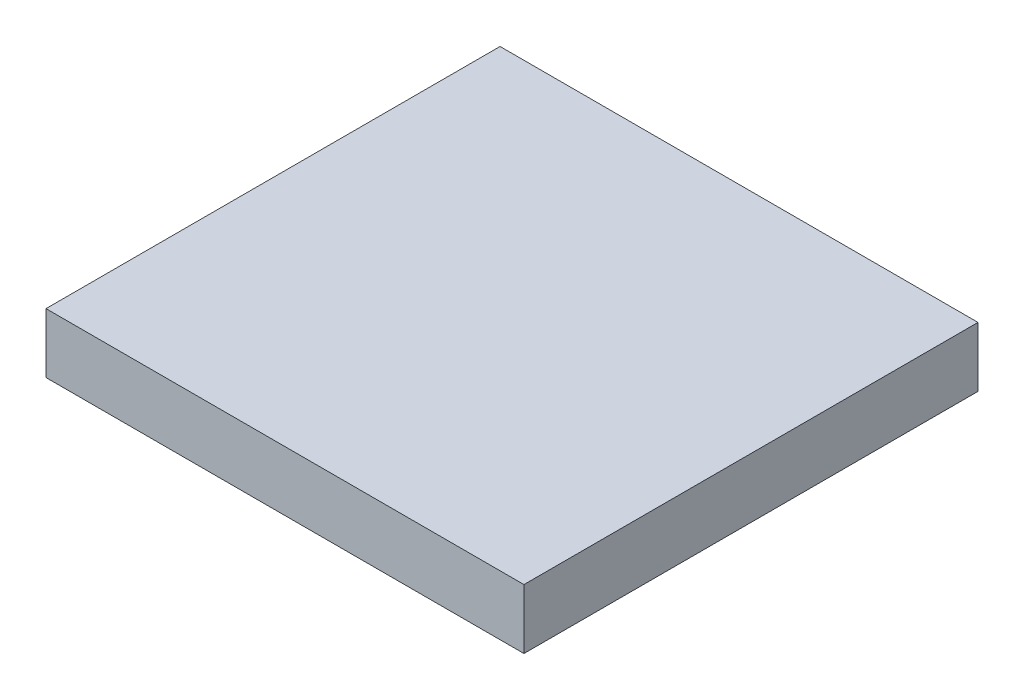
ISO-10303-21;
HEADER;
FILE_DESCRIPTION(('STEP AP214'),'2;1');
FILE_NAME('part.step','',(''),(''),'','','');
FILE_SCHEMA(('AUTOMOTIVE_DESIGN { 1 0 10303 214 1 1 1 1 }'));
ENDSEC;
DATA;
#1=APPLICATION_CONTEXT('core data for automotive mechanical design processes');
#2=APPLICATION_PROTOCOL_DEFINITION('international standard','automotive_design',2000,#1);
#3=PRODUCT_CONTEXT('',#1,'mechanical');
#4=PRODUCT('Part','Part','',(#3));
#5=PRODUCT_RELATED_PRODUCT_CATEGORY('part','',(#4));
#6=PRODUCT_DEFINITION_FORMATION('','',#4);
#7=PRODUCT_DEFINITION_CONTEXT('part definition',#1,'design');
#8=PRODUCT_DEFINITION('design','',#6,#7);
#9=PRODUCT_DEFINITION_SHAPE('','',#8);
#10=(LENGTH_UNIT() NAMED_UNIT(*) SI_UNIT(.MILLI.,.METRE.));
#11=(NAMED_UNIT(*) PLANE_ANGLE_UNIT() SI_UNIT($,.RADIAN.));
#12=(NAMED_UNIT(*) SI_UNIT($,.STERADIAN.) SOLID_ANGLE_UNIT());
#13=UNCERTAINTY_MEASURE_WITH_UNIT(LENGTH_MEASURE(1.E-05),#10,'distance_accuracy_value','');
#14=(GEOMETRIC_REPRESENTATION_CONTEXT(3) GLOBAL_UNCERTAINTY_ASSIGNED_CONTEXT((#13)) GLOBAL_UNIT_ASSIGNED_CONTEXT((#10,
#11,#12)) REPRESENTATION_CONTEXT('',''));
#15=CARTESIAN_POINT('',(0.,0.,0.));
#16=DIRECTION('',(0.,0.,1.));
#17=DIRECTION('',(1.,0.,0.));
#18=AXIS2_PLACEMENT_3D('',#15,#16,#17);
#19=CARTESIAN_POINT('',(6.35,1.5875,-5.715));
#20=DIRECTION('',(-1.,0.,0.));
#21=DIRECTION('',(0.,0.,1.));
#22=AXIS2_PLACEMENT_3D('',#19,#20,#21);
#23=PLANE('',#22);
#24=DIRECTION('',(0.,0.,-1.));
#25=VECTOR('',#24,1.);
#26=CARTESIAN_POINT('',(6.35,0.,-5.715));
#27=LINE('',#26,#25);
#28=CARTESIAN_POINT('',(6.35,0.,6.35));
#29=VERTEX_POINT('',#28);
#30=CARTESIAN_POINT('',(6.35,0.,-5.715));
#31=VERTEX_POINT('',#30);
#32=EDGE_CURVE('E102',#29,#31,#27,.T.);
#33=ORIENTED_EDGE('',*,*,#32,.T.);
#34=DIRECTION('',(0.,-1.,0.));
#35=VECTOR('',#34,1.);
#36=CARTESIAN_POINT('',(6.35,1.5875,-5.715));
#37=LINE('',#36,#35);
#38=CARTESIAN_POINT('',(6.35,1.5875,-5.715));
#39=VERTEX_POINT('',#38);
#40=EDGE_CURVE('E11',#39,#31,#37,.T.);
#41=ORIENTED_EDGE('',*,*,#40,.F.);
#42=DIRECTION('',(0.,0.,-1.));
#43=VECTOR('',#42,1.);
#44=CARTESIAN_POINT('',(6.35,1.5875,-5.715));
#45=LINE('',#44,#43);
#46=CARTESIAN_POINT('',(6.35,1.5875,6.35));
#47=VERTEX_POINT('',#46);
#48=EDGE_CURVE('E88',#47,#39,#45,.T.);
#49=ORIENTED_EDGE('',*,*,#48,.F.);
#50=DIRECTION('',(0.,-1.,0.));
#51=VECTOR('',#50,1.);
#52=CARTESIAN_POINT('',(6.35,1.5875,6.35));
#53=LINE('',#52,#51);
#54=EDGE_CURVE('E98',#47,#29,#53,.T.);
#55=ORIENTED_EDGE('',*,*,#54,.T.);
#56=EDGE_LOOP('',(#33,#41,#49,#55));
#57=FACE_BOUND('',#56,.T.);
#58=ADVANCED_FACE('F37',(#57),#23,.F.);
#59=CARTESIAN_POINT('',(-6.35,1.5875,-5.715));
#60=DIRECTION('',(0.,0.,1.));
#61=DIRECTION('',(1.,0.,0.));
#62=AXIS2_PLACEMENT_3D('',#59,#60,#61);
#63=PLANE('',#62);
#64=DIRECTION('',(-1.,0.,0.));
#65=VECTOR('',#64,1.);
#66=CARTESIAN_POINT('',(-6.35,0.,-5.715));
#67=LINE('',#66,#65);
#68=CARTESIAN_POINT('',(-6.35,0.,-5.715));
#69=VERTEX_POINT('',#68);
#70=EDGE_CURVE('E93',#31,#69,#67,.T.);
#71=ORIENTED_EDGE('',*,*,#70,.T.);
#72=DIRECTION('',(0.,-1.,0.));
#73=VECTOR('',#72,1.);
#74=CARTESIAN_POINT('',(-6.35,1.5875,-5.715));
#75=LINE('',#74,#73);
#76=CARTESIAN_POINT('',(-6.35,1.5875,-5.715));
#77=VERTEX_POINT('',#76);
#78=EDGE_CURVE('E45',#77,#69,#75,.T.);
#79=ORIENTED_EDGE('',*,*,#78,.F.);
#80=DIRECTION('',(-1.,0.,0.));
#81=VECTOR('',#80,1.);
#82=CARTESIAN_POINT('',(-6.35,1.5875,-5.715));
#83=LINE('',#82,#81);
#84=EDGE_CURVE('E83',#39,#77,#83,.T.);
#85=ORIENTED_EDGE('',*,*,#84,.F.);
#86=ORIENTED_EDGE('',*,*,#40,.T.);
#87=EDGE_LOOP('',(#71,#79,#85,#86));
#88=FACE_BOUND('',#87,.T.);
#89=ADVANCED_FACE('F92',(#88),#63,.F.);
#90=CARTESIAN_POINT('',(-6.35,1.5875,-5.715));
#91=DIRECTION('',(1.,0.,0.));
#92=DIRECTION('',(0.,0.,-1.));
#93=AXIS2_PLACEMENT_3D('',#90,#91,#92);
#94=PLANE('',#93);
#95=DIRECTION('',(0.,0.,1.));
#96=VECTOR('',#95,1.);
#97=CARTESIAN_POINT('',(-6.35,0.,-5.715));
#98=LINE('',#97,#96);
#99=CARTESIAN_POINT('',(-6.35,0.,6.35));
#100=VERTEX_POINT('',#99);
#101=EDGE_CURVE('E70',#69,#100,#98,.T.);
#102=ORIENTED_EDGE('',*,*,#101,.T.);
#103=DIRECTION('',(0.,-1.,0.));
#104=VECTOR('',#103,1.);
#105=CARTESIAN_POINT('',(-6.35,1.5875,6.35));
#106=LINE('',#105,#104);
#107=CARTESIAN_POINT('',(-6.35,1.5875,6.35));
#108=VERTEX_POINT('',#107);
#109=EDGE_CURVE('E94',#108,#100,#106,.T.);
#110=ORIENTED_EDGE('',*,*,#109,.F.);
#111=DIRECTION('',(0.,0.,1.));
#112=VECTOR('',#111,1.);
#113=CARTESIAN_POINT('',(-6.35,1.5875,-5.715));
#114=LINE('',#113,#112);
#115=EDGE_CURVE('E86',#77,#108,#114,.T.);
#116=ORIENTED_EDGE('',*,*,#115,.F.);
#117=ORIENTED_EDGE('',*,*,#78,.T.);
#118=EDGE_LOOP('',(#102,#110,#116,#117));
#119=FACE_BOUND('',#118,.T.);
#120=ADVANCED_FACE('F95',(#119),#94,.F.);
#121=CARTESIAN_POINT('',(6.35,1.5875,6.35));
#122=DIRECTION('',(0.,0.,-1.));
#123=DIRECTION('',(-1.,0.,0.));
#124=AXIS2_PLACEMENT_3D('',#121,#122,#123);
#125=PLANE('',#124);
#126=DIRECTION('',(1.,0.,0.));
#127=VECTOR('',#126,1.);
#128=CARTESIAN_POINT('',(6.35,0.,6.35));
#129=LINE('',#128,#127);
#130=EDGE_CURVE('E76',#100,#29,#129,.T.);
#131=ORIENTED_EDGE('',*,*,#130,.T.);
#132=ORIENTED_EDGE('',*,*,#54,.F.);
#133=DIRECTION('',(1.,0.,0.));
#134=VECTOR('',#133,1.);
#135=CARTESIAN_POINT('',(6.35,1.5875,6.35));
#136=LINE('',#135,#134);
#137=EDGE_CURVE('E53',#108,#47,#136,.T.);
#138=ORIENTED_EDGE('',*,*,#137,.F.);
#139=ORIENTED_EDGE('',*,*,#109,.T.);
#140=EDGE_LOOP('',(#131,#132,#138,#139));
#141=FACE_BOUND('',#140,.T.);
#142=ADVANCED_FACE('F111',(#141),#125,.F.);
#143=CARTESIAN_POINT('',(0.,1.5875,0.));
#144=DIRECTION('',(0.,-1.,0.));
#145=DIRECTION('',(0.,0.,-1.));
#146=AXIS2_PLACEMENT_3D('',#143,#144,#145);
#147=PLANE('',#146);
#148=ORIENTED_EDGE('',*,*,#48,.T.);
#149=ORIENTED_EDGE('',*,*,#84,.T.);
#150=ORIENTED_EDGE('',*,*,#115,.T.);
#151=ORIENTED_EDGE('',*,*,#137,.T.);
#152=EDGE_LOOP('',(#148,#149,#150,#151));
#153=FACE_BOUND('',#152,.T.);
#154=ADVANCED_FACE('F84',(#153),#147,.F.);
#155=CARTESIAN_POINT('',(0.,0.,0.));
#156=DIRECTION('',(0.,-1.,0.));
#157=DIRECTION('',(0.,0.,-1.));
#158=AXIS2_PLACEMENT_3D('',#155,#156,#157);
#159=PLANE('',#158);
#160=ORIENTED_EDGE('',*,*,#32,.F.);
#161=ORIENTED_EDGE('',*,*,#130,.F.);
#162=ORIENTED_EDGE('',*,*,#101,.F.);
#163=ORIENTED_EDGE('',*,*,#70,.F.);
#164=EDGE_LOOP('',(#160,#161,#162,#163));
#165=FACE_BOUND('',#164,.T.);
#166=ADVANCED_FACE('F114',(#165),#159,.T.);
#167=CLOSED_SHELL('',(#58,#89,#120,#142,#154,#166));
#168=MANIFOLD_SOLID_BREP('B2',#167);
#169=ADVANCED_BREP_SHAPE_REPRESENTATION('',(#18,#168),#14);
#170=SHAPE_DEFINITION_REPRESENTATION(#9,#169);
ENDSEC;
END-ISO-10303-21;
